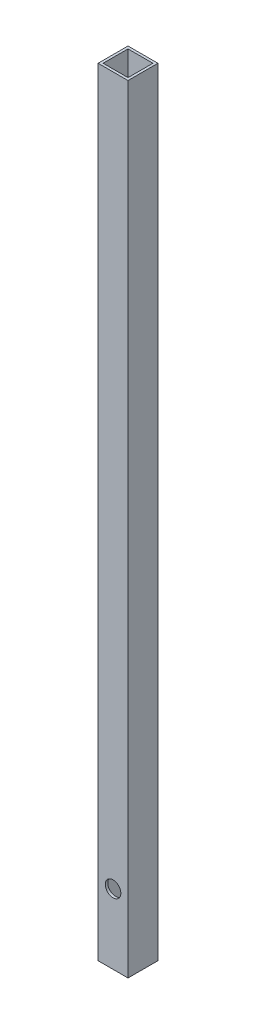
ISO-10303-21;
HEADER;
FILE_DESCRIPTION(('STEP AP214'),'2;1');
FILE_NAME('part.step','',(''),(''),'','','');
FILE_SCHEMA(('AUTOMOTIVE_DESIGN { 1 0 10303 214 1 1 1 1 }'));
ENDSEC;
DATA;
#1=APPLICATION_CONTEXT('core data for automotive mechanical design processes');
#2=APPLICATION_PROTOCOL_DEFINITION('international standard','automotive_design',2000,#1);
#3=PRODUCT_CONTEXT('',#1,'mechanical');
#4=PRODUCT('Part','Part','',(#3));
#5=PRODUCT_RELATED_PRODUCT_CATEGORY('part','',(#4));
#6=PRODUCT_DEFINITION_FORMATION('','',#4);
#7=PRODUCT_DEFINITION_CONTEXT('part definition',#1,'design');
#8=PRODUCT_DEFINITION('design','',#6,#7);
#9=PRODUCT_DEFINITION_SHAPE('','',#8);
#10=(LENGTH_UNIT() NAMED_UNIT(*) SI_UNIT(.MILLI.,.METRE.));
#11=(NAMED_UNIT(*) PLANE_ANGLE_UNIT() SI_UNIT($,.RADIAN.));
#12=(NAMED_UNIT(*) SI_UNIT($,.STERADIAN.) SOLID_ANGLE_UNIT());
#13=UNCERTAINTY_MEASURE_WITH_UNIT(LENGTH_MEASURE(1.E-05),#10,'distance_accuracy_value','');
#14=(GEOMETRIC_REPRESENTATION_CONTEXT(3) GLOBAL_UNCERTAINTY_ASSIGNED_CONTEXT((#13)) GLOBAL_UNIT_ASSIGNED_CONTEXT((#10,
#11,#12)) REPRESENTATION_CONTEXT('',''));
#15=CARTESIAN_POINT('',(0.,0.,0.));
#16=DIRECTION('',(0.,0.,1.));
#17=DIRECTION('',(1.,0.,0.));
#18=AXIS2_PLACEMENT_3D('',#15,#16,#17);
#19=CARTESIAN_POINT('',(0.,495.3,0.));
#20=DIRECTION('',(0.,1.,0.));
#21=DIRECTION('',(0.,0.,1.));
#22=AXIS2_PLACEMENT_3D('',#19,#20,#21);
#23=PLANE('',#22);
#24=DIRECTION('',(0.,0.,-1.));
#25=VECTOR('',#24,1.);
#26=CARTESIAN_POINT('',(9.525,495.3,-9.525));
#27=LINE('',#26,#25);
#28=CARTESIAN_POINT('',(9.525,495.3,9.525));
#29=VERTEX_POINT('',#28);
#30=CARTESIAN_POINT('',(9.525,495.3,-9.525));
#31=VERTEX_POINT('',#30);
#32=EDGE_CURVE('E148',#29,#31,#27,.T.);
#33=ORIENTED_EDGE('',*,*,#32,.T.);
#34=DIRECTION('',(-1.,0.,0.));
#35=VECTOR('',#34,1.);
#36=CARTESIAN_POINT('',(-9.525,495.3,-9.525));
#37=LINE('',#36,#35);
#38=CARTESIAN_POINT('',(-9.525,495.3,-9.525));
#39=VERTEX_POINT('',#38);
#40=EDGE_CURVE('E151',#31,#39,#37,.T.);
#41=ORIENTED_EDGE('',*,*,#40,.T.);
#42=DIRECTION('',(0.,0.,1.));
#43=VECTOR('',#42,1.);
#44=CARTESIAN_POINT('',(-9.525,495.3,-9.525));
#45=LINE('',#44,#43);
#46=CARTESIAN_POINT('',(-9.525,495.3,9.525));
#47=VERTEX_POINT('',#46);
#48=EDGE_CURVE('E154',#39,#47,#45,.T.);
#49=ORIENTED_EDGE('',*,*,#48,.T.);
#50=DIRECTION('',(1.,0.,0.));
#51=VECTOR('',#50,1.);
#52=CARTESIAN_POINT('',(-9.525,495.3,9.525));
#53=LINE('',#52,#51);
#54=EDGE_CURVE('E156',#47,#29,#53,.T.);
#55=ORIENTED_EDGE('',*,*,#54,.T.);
#56=EDGE_LOOP('',(#33,#41,#49,#55));
#57=FACE_BOUND('',#56,.T.);
#58=DIRECTION('',(0.,0.,1.));
#59=VECTOR('',#58,1.);
#60=CARTESIAN_POINT('',(-7.9375,495.3,-7.9375));
#61=LINE('',#60,#59);
#62=CARTESIAN_POINT('',(-7.9375,495.3,-7.9375));
#63=VERTEX_POINT('',#62);
#64=CARTESIAN_POINT('',(-7.9375,495.3,7.9375));
#65=VERTEX_POINT('',#64);
#66=EDGE_CURVE('E118',#63,#65,#61,.T.);
#67=ORIENTED_EDGE('',*,*,#66,.F.);
#68=DIRECTION('',(-1.,0.,0.));
#69=VECTOR('',#68,1.);
#70=CARTESIAN_POINT('',(-7.9375,495.3,-7.9375));
#71=LINE('',#70,#69);
#72=CARTESIAN_POINT('',(7.9375,495.3,-7.9375));
#73=VERTEX_POINT('',#72);
#74=EDGE_CURVE('E110',#73,#63,#71,.T.);
#75=ORIENTED_EDGE('',*,*,#74,.F.);
#76=DIRECTION('',(0.,0.,-1.));
#77=VECTOR('',#76,1.);
#78=CARTESIAN_POINT('',(7.9375,495.3,-7.9375));
#79=LINE('',#78,#77);
#80=CARTESIAN_POINT('',(7.9375,495.3,7.9375));
#81=VERTEX_POINT('',#80);
#82=EDGE_CURVE('E132',#81,#73,#79,.T.);
#83=ORIENTED_EDGE('',*,*,#82,.F.);
#84=DIRECTION('',(1.,0.,0.));
#85=VECTOR('',#84,1.);
#86=CARTESIAN_POINT('',(-7.9375,495.3,7.9375));
#87=LINE('',#86,#85);
#88=EDGE_CURVE('E130',#65,#81,#87,.T.);
#89=ORIENTED_EDGE('',*,*,#88,.F.);
#90=EDGE_LOOP('',(#67,#75,#83,#89));
#91=FACE_BOUND('',#90,.T.);
#92=ADVANCED_FACE('F45',(#57,#91),#23,.T.);
#93=CARTESIAN_POINT('',(0.,0.,0.));
#94=DIRECTION('',(0.,1.,0.));
#95=DIRECTION('',(0.,0.,1.));
#96=AXIS2_PLACEMENT_3D('',#93,#94,#95);
#97=PLANE('',#96);
#98=DIRECTION('',(0.,0.,-1.));
#99=VECTOR('',#98,1.);
#100=CARTESIAN_POINT('',(9.525,0.,-9.525));
#101=LINE('',#100,#99);
#102=CARTESIAN_POINT('',(9.525,0.,9.525));
#103=VERTEX_POINT('',#102);
#104=CARTESIAN_POINT('',(9.525,0.,-9.525));
#105=VERTEX_POINT('',#104);
#106=EDGE_CURVE('E126',#103,#105,#101,.T.);
#107=ORIENTED_EDGE('',*,*,#106,.F.);
#108=DIRECTION('',(1.,0.,0.));
#109=VECTOR('',#108,1.);
#110=CARTESIAN_POINT('',(-9.525,0.,9.525));
#111=LINE('',#110,#109);
#112=CARTESIAN_POINT('',(-9.525,0.,9.525));
#113=VERTEX_POINT('',#112);
#114=EDGE_CURVE('E152',#113,#103,#111,.T.);
#115=ORIENTED_EDGE('',*,*,#114,.F.);
#116=DIRECTION('',(0.,0.,1.));
#117=VECTOR('',#116,1.);
#118=CARTESIAN_POINT('',(-9.525,0.,-9.525));
#119=LINE('',#118,#117);
#120=CARTESIAN_POINT('',(-9.525,0.,-9.525));
#121=VERTEX_POINT('',#120);
#122=EDGE_CURVE('E163',#121,#113,#119,.T.);
#123=ORIENTED_EDGE('',*,*,#122,.F.);
#124=DIRECTION('',(-1.,0.,0.));
#125=VECTOR('',#124,1.);
#126=CARTESIAN_POINT('',(-9.525,0.,-9.525));
#127=LINE('',#126,#125);
#128=EDGE_CURVE('E161',#105,#121,#127,.T.);
#129=ORIENTED_EDGE('',*,*,#128,.F.);
#130=EDGE_LOOP('',(#107,#115,#123,#129));
#131=FACE_BOUND('',#130,.T.);
#132=DIRECTION('',(-1.,0.,0.));
#133=VECTOR('',#132,1.);
#134=CARTESIAN_POINT('',(-7.9375,0.,-7.9375));
#135=LINE('',#134,#133);
#136=CARTESIAN_POINT('',(7.9375,0.,-7.9375));
#137=VERTEX_POINT('',#136);
#138=CARTESIAN_POINT('',(-7.9375,0.,-7.9375));
#139=VERTEX_POINT('',#138);
#140=EDGE_CURVE('E68',#137,#139,#135,.T.);
#141=ORIENTED_EDGE('',*,*,#140,.T.);
#142=DIRECTION('',(0.,0.,1.));
#143=VECTOR('',#142,1.);
#144=CARTESIAN_POINT('',(-7.9375,0.,-7.9375));
#145=LINE('',#144,#143);
#146=CARTESIAN_POINT('',(-7.9375,0.,7.9375));
#147=VERTEX_POINT('',#146);
#148=EDGE_CURVE('E125',#139,#147,#145,.T.);
#149=ORIENTED_EDGE('',*,*,#148,.T.);
#150=DIRECTION('',(1.,0.,0.));
#151=VECTOR('',#150,1.);
#152=CARTESIAN_POINT('',(-7.9375,0.,7.9375));
#153=LINE('',#152,#151);
#154=CARTESIAN_POINT('',(7.9375,0.,7.9375));
#155=VERTEX_POINT('',#154);
#156=EDGE_CURVE('E140',#147,#155,#153,.T.);
#157=ORIENTED_EDGE('',*,*,#156,.T.);
#158=DIRECTION('',(0.,0.,-1.));
#159=VECTOR('',#158,1.);
#160=CARTESIAN_POINT('',(7.9375,0.,-7.9375));
#161=LINE('',#160,#159);
#162=EDGE_CURVE('E119',#155,#137,#161,.T.);
#163=ORIENTED_EDGE('',*,*,#162,.T.);
#164=EDGE_LOOP('',(#141,#149,#157,#163));
#165=FACE_BOUND('',#164,.T.);
#166=ADVANCED_FACE('F181',(#131,#165),#97,.F.);
#167=CARTESIAN_POINT('',(9.525,495.3,-9.525));
#168=DIRECTION('',(-1.,0.,0.));
#169=DIRECTION('',(0.,0.,1.));
#170=AXIS2_PLACEMENT_3D('',#167,#168,#169);
#171=PLANE('',#170);
#172=ORIENTED_EDGE('',*,*,#106,.T.);
#173=DIRECTION('',(0.,-1.,0.));
#174=VECTOR('',#173,1.);
#175=CARTESIAN_POINT('',(9.525,495.3,-9.525));
#176=LINE('',#175,#174);
#177=EDGE_CURVE('E13',#31,#105,#176,.T.);
#178=ORIENTED_EDGE('',*,*,#177,.F.);
#179=ORIENTED_EDGE('',*,*,#32,.F.);
#180=DIRECTION('',(0.,-1.,0.));
#181=VECTOR('',#180,1.);
#182=CARTESIAN_POINT('',(9.525,495.3,9.525));
#183=LINE('',#182,#181);
#184=EDGE_CURVE('E158',#29,#103,#183,.T.);
#185=ORIENTED_EDGE('',*,*,#184,.T.);
#186=EDGE_LOOP('',(#172,#178,#179,#185));
#187=FACE_BOUND('',#186,.T.);
#188=ADVANCED_FACE('F47',(#187),#171,.F.);
#189=CARTESIAN_POINT('',(-9.525,495.3,-9.525));
#190=DIRECTION('',(0.,0.,1.));
#191=DIRECTION('',(1.,0.,0.));
#192=AXIS2_PLACEMENT_3D('',#189,#190,#191);
#193=PLANE('',#192);
#194=ORIENTED_EDGE('',*,*,#128,.T.);
#195=DIRECTION('',(0.,-1.,0.));
#196=VECTOR('',#195,1.);
#197=CARTESIAN_POINT('',(-9.525,495.3,-9.525));
#198=LINE('',#197,#196);
#199=EDGE_CURVE('E53',#39,#121,#198,.T.);
#200=ORIENTED_EDGE('',*,*,#199,.F.);
#201=ORIENTED_EDGE('',*,*,#40,.F.);
#202=ORIENTED_EDGE('',*,*,#177,.T.);
#203=EDGE_LOOP('',(#194,#200,#201,#202));
#204=FACE_BOUND('',#203,.T.);
#205=ADVANCED_FACE('F191',(#204),#193,.F.);
#206=CARTESIAN_POINT('',(-9.525,495.3,-9.525));
#207=DIRECTION('',(1.,0.,0.));
#208=DIRECTION('',(0.,0.,-1.));
#209=AXIS2_PLACEMENT_3D('',#206,#207,#208);
#210=PLANE('',#209);
#211=CARTESIAN_POINT('',(-9.525,9.525,0.));
#212=DIRECTION('',(-1.,0.,0.));
#213=DIRECTION('',(0.,0.,1.));
#214=AXIS2_PLACEMENT_3D('',#211,#212,#213);
#215=CIRCLE('',#214,0.889);
#216=CARTESIAN_POINT('',(-9.525,9.525,0.889000000000001));
#217=VERTEX_POINT('',#216);
#218=EDGE_CURVE('E217',#217,#217,#215,.T.);
#219=ORIENTED_EDGE('',*,*,#218,.F.);
#220=EDGE_LOOP('',(#219));
#221=FACE_BOUND('',#220,.T.);
#222=ORIENTED_EDGE('',*,*,#122,.T.);
#223=DIRECTION('',(0.,-1.,0.));
#224=VECTOR('',#223,1.);
#225=CARTESIAN_POINT('',(-9.525,495.3,9.525));
#226=LINE('',#225,#224);
#227=EDGE_CURVE('E168',#47,#113,#226,.T.);
#228=ORIENTED_EDGE('',*,*,#227,.F.);
#229=ORIENTED_EDGE('',*,*,#48,.F.);
#230=ORIENTED_EDGE('',*,*,#199,.T.);
#231=EDGE_LOOP('',(#222,#228,#229,#230));
#232=FACE_BOUND('',#231,.T.);
#233=ADVANCED_FACE('F175',(#221,#232),#210,.F.);
#234=CARTESIAN_POINT('',(-9.525,495.3,9.525));
#235=DIRECTION('',(0.,0.,-1.));
#236=DIRECTION('',(-1.,0.,0.));
#237=AXIS2_PLACEMENT_3D('',#234,#235,#236);
#238=PLANE('',#237);
#239=CARTESIAN_POINT('',(0.,44.45,9.525));
#240=DIRECTION('',(0.,0.,1.));
#241=DIRECTION('',(1.,0.,0.));
#242=AXIS2_PLACEMENT_3D('',#239,#240,#241);
#243=CIRCLE('',#242,4.9609375);
#244=CARTESIAN_POINT('',(4.9609375,44.45,9.525));
#245=VERTEX_POINT('',#244);
#246=EDGE_CURVE('E215',#245,#245,#243,.T.);
#247=ORIENTED_EDGE('',*,*,#246,.F.);
#248=EDGE_LOOP('',(#247));
#249=FACE_BOUND('',#248,.T.);
#250=ORIENTED_EDGE('',*,*,#114,.T.);
#251=ORIENTED_EDGE('',*,*,#184,.F.);
#252=ORIENTED_EDGE('',*,*,#54,.F.);
#253=ORIENTED_EDGE('',*,*,#227,.T.);
#254=EDGE_LOOP('',(#250,#251,#252,#253));
#255=FACE_BOUND('',#254,.T.);
#256=ADVANCED_FACE('F185',(#249,#255),#238,.F.);
#257=CARTESIAN_POINT('',(-7.9375,495.3,-7.9375));
#258=DIRECTION('',(0.,0.,1.));
#259=DIRECTION('',(1.,0.,0.));
#260=AXIS2_PLACEMENT_3D('',#257,#258,#259);
#261=PLANE('',#260);
#262=ORIENTED_EDGE('',*,*,#140,.F.);
#263=DIRECTION('',(0.,-1.,0.));
#264=VECTOR('',#263,1.);
#265=CARTESIAN_POINT('',(7.9375,495.3,-7.9375));
#266=LINE('',#265,#264);
#267=EDGE_CURVE('E114',#73,#137,#266,.T.);
#268=ORIENTED_EDGE('',*,*,#267,.F.);
#269=ORIENTED_EDGE('',*,*,#74,.T.);
#270=DIRECTION('',(0.,-1.,0.));
#271=VECTOR('',#270,1.);
#272=CARTESIAN_POINT('',(-7.9375,495.3,-7.9375));
#273=LINE('',#272,#271);
#274=EDGE_CURVE('E113',#63,#139,#273,.T.);
#275=ORIENTED_EDGE('',*,*,#274,.T.);
#276=EDGE_LOOP('',(#262,#268,#269,#275));
#277=FACE_BOUND('',#276,.T.);
#278=ADVANCED_FACE('F112',(#277),#261,.T.);
#279=CARTESIAN_POINT('',(-7.9375,495.3,-7.9375));
#280=DIRECTION('',(1.,0.,0.));
#281=DIRECTION('',(0.,0.,-1.));
#282=AXIS2_PLACEMENT_3D('',#279,#280,#281);
#283=PLANE('',#282);
#284=CARTESIAN_POINT('',(-7.9375,9.525,0.));
#285=DIRECTION('',(1.,0.,0.));
#286=DIRECTION('',(0.,0.,-1.));
#287=AXIS2_PLACEMENT_3D('',#284,#285,#286);
#288=CIRCLE('',#287,0.889);
#289=CARTESIAN_POINT('',(-7.9375,9.525,-0.888999999999998));
#290=VERTEX_POINT('',#289);
#291=EDGE_CURVE('E221',#290,#290,#288,.F.);
#292=ORIENTED_EDGE('',*,*,#291,.T.);
#293=EDGE_LOOP('',(#292));
#294=FACE_BOUND('',#293,.T.);
#295=ORIENTED_EDGE('',*,*,#148,.F.);
#296=ORIENTED_EDGE('',*,*,#274,.F.);
#297=ORIENTED_EDGE('',*,*,#66,.T.);
#298=DIRECTION('',(0.,-1.,0.));
#299=VECTOR('',#298,1.);
#300=CARTESIAN_POINT('',(-7.9375,495.3,7.9375));
#301=LINE('',#300,#299);
#302=EDGE_CURVE('E127',#65,#147,#301,.T.);
#303=ORIENTED_EDGE('',*,*,#302,.T.);
#304=EDGE_LOOP('',(#295,#296,#297,#303));
#305=FACE_BOUND('',#304,.T.);
#306=ADVANCED_FACE('F122',(#294,#305),#283,.T.);
#307=CARTESIAN_POINT('',(-7.9375,495.3,7.9375));
#308=DIRECTION('',(0.,0.,-1.));
#309=DIRECTION('',(-1.,0.,0.));
#310=AXIS2_PLACEMENT_3D('',#307,#308,#309);
#311=PLANE('',#310);
#312=CARTESIAN_POINT('',(0.,44.45,7.9375));
#313=DIRECTION('',(0.,0.,-1.));
#314=DIRECTION('',(-1.,0.,0.));
#315=AXIS2_PLACEMENT_3D('',#312,#313,#314);
#316=CIRCLE('',#315,4.9609375);
#317=CARTESIAN_POINT('',(-4.9609375,44.45,7.9375));
#318=VERTEX_POINT('',#317);
#319=EDGE_CURVE('E138',#318,#318,#316,.F.);
#320=ORIENTED_EDGE('',*,*,#319,.T.);
#321=EDGE_LOOP('',(#320));
#322=FACE_BOUND('',#321,.T.);
#323=ORIENTED_EDGE('',*,*,#156,.F.);
#324=ORIENTED_EDGE('',*,*,#302,.F.);
#325=ORIENTED_EDGE('',*,*,#88,.T.);
#326=DIRECTION('',(0.,-1.,0.));
#327=VECTOR('',#326,1.);
#328=CARTESIAN_POINT('',(7.9375,495.3,7.9375));
#329=LINE('',#328,#327);
#330=EDGE_CURVE('E60',#81,#155,#329,.T.);
#331=ORIENTED_EDGE('',*,*,#330,.T.);
#332=EDGE_LOOP('',(#323,#324,#325,#331));
#333=FACE_BOUND('',#332,.T.);
#334=ADVANCED_FACE('F242',(#322,#333),#311,.T.);
#335=CARTESIAN_POINT('',(7.9375,495.3,-7.9375));
#336=DIRECTION('',(-1.,0.,0.));
#337=DIRECTION('',(0.,0.,1.));
#338=AXIS2_PLACEMENT_3D('',#335,#336,#337);
#339=PLANE('',#338);
#340=ORIENTED_EDGE('',*,*,#162,.F.);
#341=ORIENTED_EDGE('',*,*,#330,.F.);
#342=ORIENTED_EDGE('',*,*,#82,.T.);
#343=ORIENTED_EDGE('',*,*,#267,.T.);
#344=EDGE_LOOP('',(#340,#341,#342,#343));
#345=FACE_BOUND('',#344,.T.);
#346=ADVANCED_FACE('F237',(#345),#339,.T.);
#347=CARTESIAN_POINT('',(0.,44.45,-6.09415018917055));
#348=DIRECTION('',(0.,0.,1.));
#349=DIRECTION('',(1.,0.,0.));
#350=AXIS2_PLACEMENT_3D('',#347,#348,#349);
#351=CYLINDRICAL_SURFACE('',#350,4.9609375);
#352=ORIENTED_EDGE('',*,*,#246,.T.);
#353=EDGE_LOOP('',(#352));
#354=FACE_BOUND('',#353,.T.);
#355=ORIENTED_EDGE('',*,*,#319,.F.);
#356=EDGE_LOOP('',(#355));
#357=FACE_BOUND('',#356,.T.);
#358=ADVANCED_FACE('F231',(#354,#357),#351,.F.);
#359=CARTESIAN_POINT('',(9.52600000000001,9.525,0.));
#360=DIRECTION('',(-1.,0.,0.));
#361=DIRECTION('',(0.,0.,1.));
#362=AXIS2_PLACEMENT_3D('',#359,#360,#361);
#363=CYLINDRICAL_SURFACE('',#362,0.889);
#364=ORIENTED_EDGE('',*,*,#291,.F.);
#365=EDGE_LOOP('',(#364));
#366=FACE_BOUND('',#365,.T.);
#367=ORIENTED_EDGE('',*,*,#218,.T.);
#368=EDGE_LOOP('',(#367));
#369=FACE_BOUND('',#368,.T.);
#370=ADVANCED_FACE('F228',(#366,#369),#363,.F.);
#371=CLOSED_SHELL('',(#92,#166,#188,#205,#233,#256,#278,#306,#334,#346,#358,#370));
#372=MANIFOLD_SOLID_BREP('B2',#371);
#373=ADVANCED_BREP_SHAPE_REPRESENTATION('',(#18,#372),#14);
#374=SHAPE_DEFINITION_REPRESENTATION(#9,#373);
ENDSEC;
END-ISO-10303-21;
